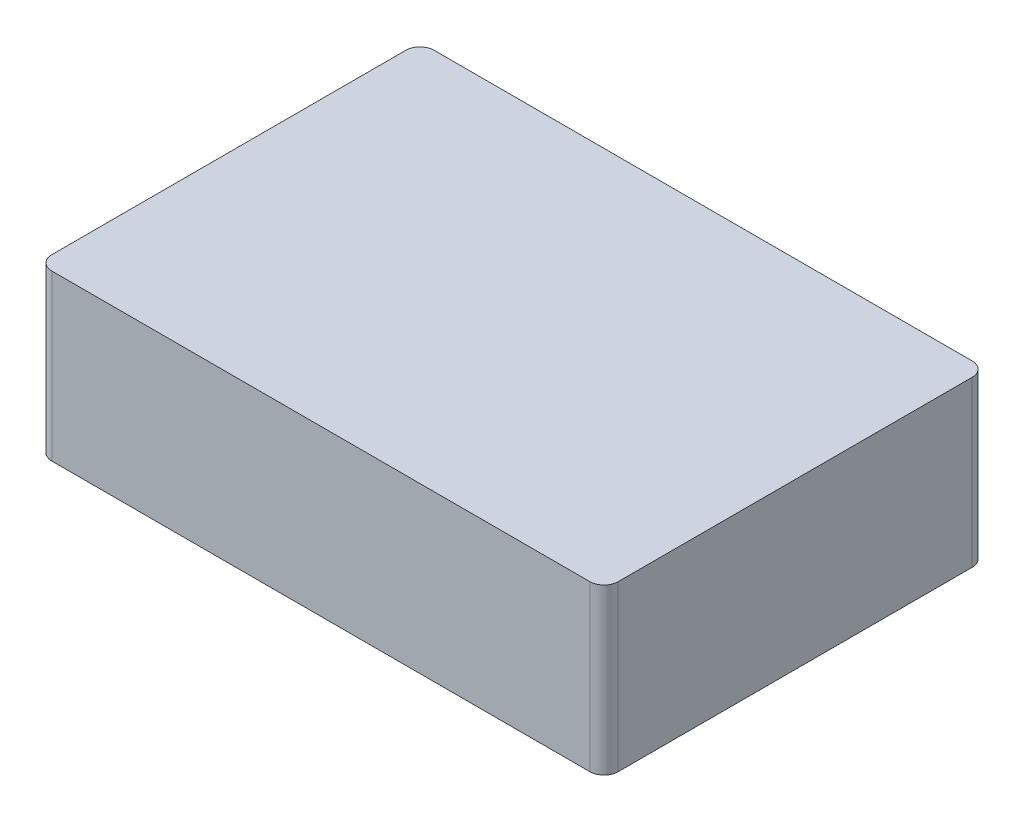
ISO-10303-21;
HEADER;
FILE_DESCRIPTION(('STEP AP214'),'2;1');
FILE_NAME('part.step','',(''),(''),'','','');
FILE_SCHEMA(('AUTOMOTIVE_DESIGN { 1 0 10303 214 1 1 1 1 }'));
ENDSEC;
DATA;
#1=APPLICATION_CONTEXT('core data for automotive mechanical design processes');
#2=APPLICATION_PROTOCOL_DEFINITION('international standard','automotive_design',2000,#1);
#3=PRODUCT_CONTEXT('',#1,'mechanical');
#4=PRODUCT('Part','Part','',(#3));
#5=PRODUCT_RELATED_PRODUCT_CATEGORY('part','',(#4));
#6=PRODUCT_DEFINITION_FORMATION('','',#4);
#7=PRODUCT_DEFINITION_CONTEXT('part definition',#1,'design');
#8=PRODUCT_DEFINITION('design','',#6,#7);
#9=PRODUCT_DEFINITION_SHAPE('','',#8);
#10=(LENGTH_UNIT() NAMED_UNIT(*) SI_UNIT(.MILLI.,.METRE.));
#11=(NAMED_UNIT(*) PLANE_ANGLE_UNIT() SI_UNIT($,.RADIAN.));
#12=(NAMED_UNIT(*) SI_UNIT($,.STERADIAN.) SOLID_ANGLE_UNIT());
#13=UNCERTAINTY_MEASURE_WITH_UNIT(LENGTH_MEASURE(1.E-05),#10,'distance_accuracy_value','');
#14=(GEOMETRIC_REPRESENTATION_CONTEXT(3) GLOBAL_UNCERTAINTY_ASSIGNED_CONTEXT((#13)) GLOBAL_UNIT_ASSIGNED_CONTEXT((#10,
#11,#12)) REPRESENTATION_CONTEXT('',''));
#15=CARTESIAN_POINT('',(0.,0.,0.));
#16=DIRECTION('',(0.,0.,1.));
#17=DIRECTION('',(1.,0.,0.));
#18=AXIS2_PLACEMENT_3D('',#15,#16,#17);
#19=CARTESIAN_POINT('',(0.,23.25,0.));
#20=DIRECTION('',(1.,0.,0.));
#21=DIRECTION('',(0.,0.,-1.));
#22=AXIS2_PLACEMENT_3D('',#19,#20,#21);
#23=PLANE('',#22);
#24=DIRECTION('',(0.,0.,1.));
#25=VECTOR('',#24,1.);
#26=CARTESIAN_POINT('',(0.,23.25,0.));
#27=LINE('',#26,#25);
#28=CARTESIAN_POINT('',(0.,23.25,-52.));
#29=VERTEX_POINT('',#28);
#30=CARTESIAN_POINT('',(0.,23.25,-2.));
#31=VERTEX_POINT('',#30);
#32=EDGE_CURVE('E117',#29,#31,#27,.T.);
#33=ORIENTED_EDGE('',*,*,#32,.F.);
#34=DIRECTION('',(0.,-1.,0.));
#35=VECTOR('',#34,1.);
#36=CARTESIAN_POINT('',(0.,23.25,-52.));
#37=LINE('',#36,#35);
#38=CARTESIAN_POINT('',(0.,0.,-52.));
#39=VERTEX_POINT('',#38);
#40=EDGE_CURVE('E102',#29,#39,#37,.T.);
#41=ORIENTED_EDGE('',*,*,#40,.T.);
#42=DIRECTION('',(0.,0.,1.));
#43=VECTOR('',#42,1.);
#44=CARTESIAN_POINT('',(0.,0.,0.));
#45=LINE('',#44,#43);
#46=CARTESIAN_POINT('',(0.,0.,-2.));
#47=VERTEX_POINT('',#46);
#48=EDGE_CURVE('E114',#39,#47,#45,.T.);
#49=ORIENTED_EDGE('',*,*,#48,.T.);
#50=DIRECTION('',(0.,-1.,0.));
#51=VECTOR('',#50,1.);
#52=CARTESIAN_POINT('',(0.,23.25,-2.));
#53=LINE('',#52,#51);
#54=EDGE_CURVE('E119',#47,#31,#53,.F.);
#55=ORIENTED_EDGE('',*,*,#54,.T.);
#56=EDGE_LOOP('',(#33,#41,#49,#55));
#57=FACE_BOUND('',#56,.T.);
#58=ADVANCED_FACE('F33',(#57),#23,.F.);
#59=CARTESIAN_POINT('',(0.,23.25,0.));
#60=DIRECTION('',(0.,0.,-1.));
#61=DIRECTION('',(-1.,0.,0.));
#62=AXIS2_PLACEMENT_3D('',#59,#60,#61);
#63=PLANE('',#62);
#64=DIRECTION('',(1.,0.,0.));
#65=VECTOR('',#64,1.);
#66=CARTESIAN_POINT('',(0.,23.25,0.));
#67=LINE('',#66,#65);
#68=CARTESIAN_POINT('',(2.,23.25,0.));
#69=VERTEX_POINT('',#68);
#70=CARTESIAN_POINT('',(78.,23.25,0.));
#71=VERTEX_POINT('',#70);
#72=EDGE_CURVE('E168',#69,#71,#67,.T.);
#73=ORIENTED_EDGE('',*,*,#72,.F.);
#74=DIRECTION('',(0.,-1.,0.));
#75=VECTOR('',#74,1.);
#76=CARTESIAN_POINT('',(2.,23.25,0.));
#77=LINE('',#76,#75);
#78=CARTESIAN_POINT('',(2.,0.,0.));
#79=VERTEX_POINT('',#78);
#80=EDGE_CURVE('E152',#69,#79,#77,.T.);
#81=ORIENTED_EDGE('',*,*,#80,.T.);
#82=DIRECTION('',(1.,0.,0.));
#83=VECTOR('',#82,1.);
#84=CARTESIAN_POINT('',(0.,0.,0.));
#85=LINE('',#84,#83);
#86=CARTESIAN_POINT('',(78.,0.,0.));
#87=VERTEX_POINT('',#86);
#88=EDGE_CURVE('E123',#79,#87,#85,.T.);
#89=ORIENTED_EDGE('',*,*,#88,.T.);
#90=DIRECTION('',(0.,-1.,0.));
#91=VECTOR('',#90,1.);
#92=CARTESIAN_POINT('',(78.,23.25,0.));
#93=LINE('',#92,#91);
#94=EDGE_CURVE('E150',#87,#71,#93,.F.);
#95=ORIENTED_EDGE('',*,*,#94,.T.);
#96=EDGE_LOOP('',(#73,#81,#89,#95));
#97=FACE_BOUND('',#96,.T.);
#98=ADVANCED_FACE('F178',(#97),#63,.F.);
#99=CARTESIAN_POINT('',(80.,23.25,0.));
#100=DIRECTION('',(-1.,0.,0.));
#101=DIRECTION('',(0.,0.,1.));
#102=AXIS2_PLACEMENT_3D('',#99,#100,#101);
#103=PLANE('',#102);
#104=DIRECTION('',(0.,0.,-1.));
#105=VECTOR('',#104,1.);
#106=CARTESIAN_POINT('',(80.,0.,0.));
#107=LINE('',#106,#105);
#108=CARTESIAN_POINT('',(80.,0.,-2.));
#109=VERTEX_POINT('',#108);
#110=CARTESIAN_POINT('',(80.,0.,-52.));
#111=VERTEX_POINT('',#110);
#112=EDGE_CURVE('E126',#109,#111,#107,.T.);
#113=ORIENTED_EDGE('',*,*,#112,.T.);
#114=DIRECTION('',(0.,-1.,0.));
#115=VECTOR('',#114,1.);
#116=CARTESIAN_POINT('',(80.,23.25,-52.));
#117=LINE('',#116,#115);
#118=CARTESIAN_POINT('',(80.,23.25,-52.));
#119=VERTEX_POINT('',#118);
#120=EDGE_CURVE('E11',#111,#119,#117,.F.);
#121=ORIENTED_EDGE('',*,*,#120,.T.);
#122=DIRECTION('',(0.,0.,-1.));
#123=VECTOR('',#122,1.);
#124=CARTESIAN_POINT('',(80.,23.25,0.));
#125=LINE('',#124,#123);
#126=CARTESIAN_POINT('',(80.,23.25,-2.));
#127=VERTEX_POINT('',#126);
#128=EDGE_CURVE('E158',#127,#119,#125,.T.);
#129=ORIENTED_EDGE('',*,*,#128,.F.);
#130=DIRECTION('',(0.,-1.,0.));
#131=VECTOR('',#130,1.);
#132=CARTESIAN_POINT('',(80.,23.25,-2.));
#133=LINE('',#132,#131);
#134=EDGE_CURVE('E41',#127,#109,#133,.T.);
#135=ORIENTED_EDGE('',*,*,#134,.T.);
#136=EDGE_LOOP('',(#113,#121,#129,#135));
#137=FACE_BOUND('',#136,.T.);
#138=ADVANCED_FACE('F157',(#137),#103,.F.);
#139=CARTESIAN_POINT('',(0.,23.25,-54.));
#140=DIRECTION('',(0.,0.,1.));
#141=DIRECTION('',(1.,0.,0.));
#142=AXIS2_PLACEMENT_3D('',#139,#140,#141);
#143=PLANE('',#142);
#144=DIRECTION('',(-1.,0.,0.));
#145=VECTOR('',#144,1.);
#146=CARTESIAN_POINT('',(0.,0.,-54.));
#147=LINE('',#146,#145);
#148=CARTESIAN_POINT('',(78.,0.,-54.));
#149=VERTEX_POINT('',#148);
#150=CARTESIAN_POINT('',(2.,0.,-54.));
#151=VERTEX_POINT('',#150);
#152=EDGE_CURVE('E133',#149,#151,#147,.T.);
#153=ORIENTED_EDGE('',*,*,#152,.T.);
#154=DIRECTION('',(0.,-1.,0.));
#155=VECTOR('',#154,1.);
#156=CARTESIAN_POINT('',(2.,23.25,-54.));
#157=LINE('',#156,#155);
#158=CARTESIAN_POINT('',(2.,23.25,-54.));
#159=VERTEX_POINT('',#158);
#160=EDGE_CURVE('E103',#151,#159,#157,.F.);
#161=ORIENTED_EDGE('',*,*,#160,.T.);
#162=DIRECTION('',(-1.,0.,0.));
#163=VECTOR('',#162,1.);
#164=CARTESIAN_POINT('',(0.,23.25,-54.));
#165=LINE('',#164,#163);
#166=CARTESIAN_POINT('',(78.,23.25,-54.));
#167=VERTEX_POINT('',#166);
#168=EDGE_CURVE('E129',#167,#159,#165,.T.);
#169=ORIENTED_EDGE('',*,*,#168,.F.);
#170=DIRECTION('',(0.,-1.,0.));
#171=VECTOR('',#170,1.);
#172=CARTESIAN_POINT('',(78.,23.25,-54.));
#173=LINE('',#172,#171);
#174=EDGE_CURVE('E108',#167,#149,#173,.T.);
#175=ORIENTED_EDGE('',*,*,#174,.T.);
#176=EDGE_LOOP('',(#153,#161,#169,#175));
#177=FACE_BOUND('',#176,.T.);
#178=ADVANCED_FACE('F166',(#177),#143,.F.);
#179=CARTESIAN_POINT('',(0.,23.25,0.));
#180=DIRECTION('',(0.,-1.,0.));
#181=DIRECTION('',(0.,0.,-1.));
#182=AXIS2_PLACEMENT_3D('',#179,#180,#181);
#183=PLANE('',#182);
#184=ORIENTED_EDGE('',*,*,#168,.T.);
#185=CARTESIAN_POINT('',(2.,23.25,-52.));
#186=DIRECTION('',(0.,-1.,0.));
#187=DIRECTION('',(0.,0.,-1.));
#188=AXIS2_PLACEMENT_3D('',#185,#186,#187);
#189=CIRCLE('',#188,2.);
#190=EDGE_CURVE('E148',#159,#29,#189,.F.);
#191=ORIENTED_EDGE('',*,*,#190,.T.);
#192=ORIENTED_EDGE('',*,*,#32,.T.);
#193=CARTESIAN_POINT('',(2.,23.25,-2.));
#194=DIRECTION('',(0.,-1.,0.));
#195=DIRECTION('',(0.,0.,-1.));
#196=AXIS2_PLACEMENT_3D('',#193,#194,#195);
#197=CIRCLE('',#196,2.);
#198=EDGE_CURVE('E146',#31,#69,#197,.F.);
#199=ORIENTED_EDGE('',*,*,#198,.T.);
#200=ORIENTED_EDGE('',*,*,#72,.T.);
#201=CARTESIAN_POINT('',(78.,23.25,-2.));
#202=DIRECTION('',(0.,-1.,0.));
#203=DIRECTION('',(0.,0.,-1.));
#204=AXIS2_PLACEMENT_3D('',#201,#202,#203);
#205=CIRCLE('',#204,2.);
#206=EDGE_CURVE('E53',#71,#127,#205,.F.);
#207=ORIENTED_EDGE('',*,*,#206,.T.);
#208=ORIENTED_EDGE('',*,*,#128,.T.);
#209=CARTESIAN_POINT('',(78.,23.25,-52.));
#210=DIRECTION('',(0.,-1.,0.));
#211=DIRECTION('',(0.,0.,-1.));
#212=AXIS2_PLACEMENT_3D('',#209,#210,#211);
#213=CIRCLE('',#212,2.);
#214=EDGE_CURVE('E144',#119,#167,#213,.F.);
#215=ORIENTED_EDGE('',*,*,#214,.T.);
#216=EDGE_LOOP('',(#184,#191,#192,#199,#200,#207,#208,#215));
#217=FACE_BOUND('',#216,.T.);
#218=ADVANCED_FACE('F172',(#217),#183,.F.);
#219=CARTESIAN_POINT('',(0.,0.,0.));
#220=DIRECTION('',(0.,-1.,0.));
#221=DIRECTION('',(0.,0.,-1.));
#222=AXIS2_PLACEMENT_3D('',#219,#220,#221);
#223=PLANE('',#222);
#224=ORIENTED_EDGE('',*,*,#48,.F.);
#225=CARTESIAN_POINT('',(2.,0.,-52.));
#226=DIRECTION('',(0.,-1.,0.));
#227=DIRECTION('',(0.,0.,-1.));
#228=AXIS2_PLACEMENT_3D('',#225,#226,#227);
#229=CIRCLE('',#228,2.);
#230=EDGE_CURVE('E98',#39,#151,#229,.T.);
#231=ORIENTED_EDGE('',*,*,#230,.T.);
#232=ORIENTED_EDGE('',*,*,#152,.F.);
#233=CARTESIAN_POINT('',(78.,0.,-52.));
#234=DIRECTION('',(0.,-1.,0.));
#235=DIRECTION('',(0.,0.,-1.));
#236=AXIS2_PLACEMENT_3D('',#233,#234,#235);
#237=CIRCLE('',#236,2.);
#238=EDGE_CURVE('E137',#149,#111,#237,.T.);
#239=ORIENTED_EDGE('',*,*,#238,.T.);
#240=ORIENTED_EDGE('',*,*,#112,.F.);
#241=CARTESIAN_POINT('',(78.,0.,-2.));
#242=DIRECTION('',(0.,-1.,0.));
#243=DIRECTION('',(0.,0.,-1.));
#244=AXIS2_PLACEMENT_3D('',#241,#242,#243);
#245=CIRCLE('',#244,2.);
#246=EDGE_CURVE('E118',#109,#87,#245,.T.);
#247=ORIENTED_EDGE('',*,*,#246,.T.);
#248=ORIENTED_EDGE('',*,*,#88,.F.);
#249=CARTESIAN_POINT('',(2.,0.,-2.));
#250=DIRECTION('',(0.,-1.,0.));
#251=DIRECTION('',(0.,0.,-1.));
#252=AXIS2_PLACEMENT_3D('',#249,#250,#251);
#253=CIRCLE('',#252,2.);
#254=EDGE_CURVE('E109',#79,#47,#253,.T.);
#255=ORIENTED_EDGE('',*,*,#254,.T.);
#256=EDGE_LOOP('',(#224,#231,#232,#239,#240,#247,#248,#255));
#257=FACE_BOUND('',#256,.T.);
#258=ADVANCED_FACE('F121',(#257),#223,.T.);
#259=CARTESIAN_POINT('',(2.,23.25,-52.));
#260=DIRECTION('',(0.,-1.,0.));
#261=DIRECTION('',(0.,0.,-1.));
#262=AXIS2_PLACEMENT_3D('',#259,#260,#261);
#263=CYLINDRICAL_SURFACE('',#262,2.);
#264=ORIENTED_EDGE('',*,*,#190,.F.);
#265=ORIENTED_EDGE('',*,*,#160,.F.);
#266=ORIENTED_EDGE('',*,*,#230,.F.);
#267=ORIENTED_EDGE('',*,*,#40,.F.);
#268=EDGE_LOOP('',(#264,#265,#266,#267));
#269=FACE_BOUND('',#268,.T.);
#270=ADVANCED_FACE('F101',(#269),#263,.T.);
#271=CARTESIAN_POINT('',(2.,23.25,-2.));
#272=DIRECTION('',(0.,-1.,0.));
#273=DIRECTION('',(0.,0.,-1.));
#274=AXIS2_PLACEMENT_3D('',#271,#272,#273);
#275=CYLINDRICAL_SURFACE('',#274,2.);
#276=ORIENTED_EDGE('',*,*,#198,.F.);
#277=ORIENTED_EDGE('',*,*,#54,.F.);
#278=ORIENTED_EDGE('',*,*,#254,.F.);
#279=ORIENTED_EDGE('',*,*,#80,.F.);
#280=EDGE_LOOP('',(#276,#277,#278,#279));
#281=FACE_BOUND('',#280,.T.);
#282=ADVANCED_FACE('F176',(#281),#275,.T.);
#283=CARTESIAN_POINT('',(78.,23.25,-52.));
#284=DIRECTION('',(0.,-1.,0.));
#285=DIRECTION('',(0.,0.,-1.));
#286=AXIS2_PLACEMENT_3D('',#283,#284,#285);
#287=CYLINDRICAL_SURFACE('',#286,2.);
#288=ORIENTED_EDGE('',*,*,#214,.F.);
#289=ORIENTED_EDGE('',*,*,#120,.F.);
#290=ORIENTED_EDGE('',*,*,#238,.F.);
#291=ORIENTED_EDGE('',*,*,#174,.F.);
#292=EDGE_LOOP('',(#288,#289,#290,#291));
#293=FACE_BOUND('',#292,.T.);
#294=ADVANCED_FACE('F163',(#293),#287,.T.);
#295=CARTESIAN_POINT('',(78.,23.25,-2.));
#296=DIRECTION('',(0.,-1.,0.));
#297=DIRECTION('',(0.,0.,-1.));
#298=AXIS2_PLACEMENT_3D('',#295,#296,#297);
#299=CYLINDRICAL_SURFACE('',#298,2.);
#300=ORIENTED_EDGE('',*,*,#206,.F.);
#301=ORIENTED_EDGE('',*,*,#94,.F.);
#302=ORIENTED_EDGE('',*,*,#246,.F.);
#303=ORIENTED_EDGE('',*,*,#134,.F.);
#304=EDGE_LOOP('',(#300,#301,#302,#303));
#305=FACE_BOUND('',#304,.T.);
#306=ADVANCED_FACE('F35',(#305),#299,.T.);
#307=CLOSED_SHELL('',(#58,#98,#138,#178,#218,#258,#270,#282,#294,#306));
#308=MANIFOLD_SOLID_BREP('B2',#307);
#309=ADVANCED_BREP_SHAPE_REPRESENTATION('',(#18,#308),#14);
#310=SHAPE_DEFINITION_REPRESENTATION(#9,#309);
ENDSEC;
END-ISO-10303-21;
